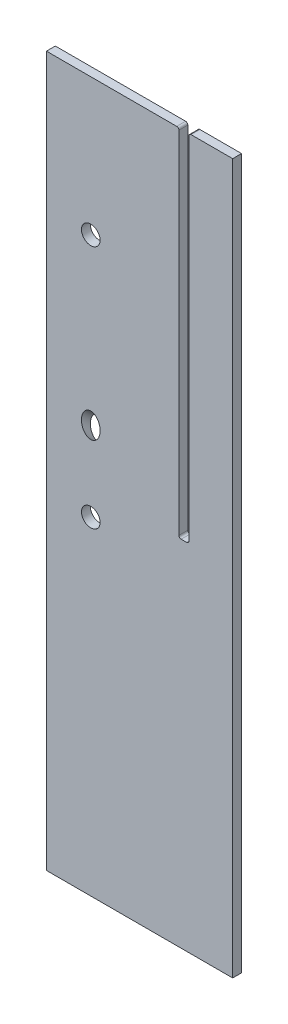
ISO-10303-21;
HEADER;
FILE_DESCRIPTION(('STEP AP214'),'2;1');
FILE_NAME('part.step','',(''),(''),'','','');
FILE_SCHEMA(('AUTOMOTIVE_DESIGN { 1 0 10303 214 1 1 1 1 }'));
ENDSEC;
DATA;
#1=APPLICATION_CONTEXT('core data for automotive mechanical design processes');
#2=APPLICATION_PROTOCOL_DEFINITION('international standard','automotive_design',2000,#1);
#3=PRODUCT_CONTEXT('',#1,'mechanical');
#4=PRODUCT('Part','Part','',(#3));
#5=PRODUCT_RELATED_PRODUCT_CATEGORY('part','',(#4));
#6=PRODUCT_DEFINITION_FORMATION('','',#4);
#7=PRODUCT_DEFINITION_CONTEXT('part definition',#1,'design');
#8=PRODUCT_DEFINITION('design','',#6,#7);
#9=PRODUCT_DEFINITION_SHAPE('','',#8);
#10=(LENGTH_UNIT() NAMED_UNIT(*) SI_UNIT(.MILLI.,.METRE.));
#11=(NAMED_UNIT(*) PLANE_ANGLE_UNIT() SI_UNIT($,.RADIAN.));
#12=(NAMED_UNIT(*) SI_UNIT($,.STERADIAN.) SOLID_ANGLE_UNIT());
#13=UNCERTAINTY_MEASURE_WITH_UNIT(LENGTH_MEASURE(1.E-05),#10,'distance_accuracy_value','');
#14=(GEOMETRIC_REPRESENTATION_CONTEXT(3) GLOBAL_UNCERTAINTY_ASSIGNED_CONTEXT((#13)) GLOBAL_UNIT_ASSIGNED_CONTEXT((#10,
#11,#12)) REPRESENTATION_CONTEXT('',''));
#15=CARTESIAN_POINT('',(0.,0.,0.));
#16=DIRECTION('',(0.,0.,1.));
#17=DIRECTION('',(1.,0.,0.));
#18=AXIS2_PLACEMENT_3D('',#15,#16,#17);
#19=CARTESIAN_POINT('',(-133.35,1016.,6.35));
#20=DIRECTION('',(0.,-1.,0.));
#21=DIRECTION('',(0.,0.,-1.));
#22=AXIS2_PLACEMENT_3D('',#19,#20,#21);
#23=PLANE('',#22);
#24=DIRECTION('',(-1.,0.,0.));
#25=VECTOR('',#24,1.);
#26=CARTESIAN_POINT('',(-133.35,1016.,-6.35));
#27=LINE('',#26,#25);
#28=CARTESIAN_POINT('',(133.35,1016.,-6.35));
#29=VERTEX_POINT('',#28);
#30=CARTESIAN_POINT('',(73.787,1016.,-6.35));
#31=VERTEX_POINT('',#30);
#32=EDGE_CURVE('E149',#29,#31,#27,.T.);
#33=ORIENTED_EDGE('',*,*,#32,.T.);
#34=DIRECTION('',(0.,0.,1.));
#35=VECTOR('',#34,1.);
#36=CARTESIAN_POINT('',(73.787,1016.,6.35));
#37=LINE('',#36,#35);
#38=CARTESIAN_POINT('',(73.787,1016.,6.35));
#39=VERTEX_POINT('',#38);
#40=EDGE_CURVE('E207',#31,#39,#37,.T.);
#41=ORIENTED_EDGE('',*,*,#40,.T.);
#42=DIRECTION('',(-1.,0.,0.));
#43=VECTOR('',#42,1.);
#44=CARTESIAN_POINT('',(-133.35,1016.,6.35));
#45=LINE('',#44,#43);
#46=CARTESIAN_POINT('',(133.35,1016.,6.35));
#47=VERTEX_POINT('',#46);
#48=EDGE_CURVE('E176',#47,#39,#45,.T.);
#49=ORIENTED_EDGE('',*,*,#48,.F.);
#50=DIRECTION('',(0.,0.,-1.));
#51=VECTOR('',#50,1.);
#52=CARTESIAN_POINT('',(133.35,1016.,6.35));
#53=LINE('',#52,#51);
#54=EDGE_CURVE('E189',#47,#29,#53,.T.);
#55=ORIENTED_EDGE('',*,*,#54,.T.);
#56=EDGE_LOOP('',(#33,#41,#49,#55));
#57=FACE_BOUND('',#56,.T.);
#58=ADVANCED_FACE('F46',(#57),#23,.F.);
#59=CARTESIAN_POINT('',(-133.35,0.,6.35));
#60=DIRECTION('',(1.,0.,0.));
#61=DIRECTION('',(0.,1.,0.));
#62=AXIS2_PLACEMENT_3D('',#59,#60,#61);
#63=PLANE('',#62);
#64=DIRECTION('',(0.,-1.,0.));
#65=VECTOR('',#64,1.);
#66=CARTESIAN_POINT('',(-133.35,0.,-6.35));
#67=LINE('',#66,#65);
#68=CARTESIAN_POINT('',(-133.35,1016.,-6.35));
#69=VERTEX_POINT('',#68);
#70=CARTESIAN_POINT('',(-133.35,0.,-6.35));
#71=VERTEX_POINT('',#70);
#72=EDGE_CURVE('E156',#69,#71,#67,.T.);
#73=ORIENTED_EDGE('',*,*,#72,.T.);
#74=DIRECTION('',(0.,0.,-1.));
#75=VECTOR('',#74,1.);
#76=CARTESIAN_POINT('',(-133.35,0.,6.35));
#77=LINE('',#76,#75);
#78=CARTESIAN_POINT('',(-133.35,0.,6.35));
#79=VERTEX_POINT('',#78);
#80=EDGE_CURVE('E331',#79,#71,#77,.T.);
#81=ORIENTED_EDGE('',*,*,#80,.F.);
#82=DIRECTION('',(0.,-1.,0.));
#83=VECTOR('',#82,1.);
#84=CARTESIAN_POINT('',(-133.35,0.,6.35));
#85=LINE('',#84,#83);
#86=CARTESIAN_POINT('',(-133.35,1016.,6.35));
#87=VERTEX_POINT('',#86);
#88=EDGE_CURVE('E158',#87,#79,#85,.T.);
#89=ORIENTED_EDGE('',*,*,#88,.F.);
#90=DIRECTION('',(0.,0.,-1.));
#91=VECTOR('',#90,1.);
#92=CARTESIAN_POINT('',(-133.35,1016.,6.35));
#93=LINE('',#92,#91);
#94=EDGE_CURVE('E142',#87,#69,#93,.T.);
#95=ORIENTED_EDGE('',*,*,#94,.T.);
#96=EDGE_LOOP('',(#73,#81,#89,#95));
#97=FACE_BOUND('',#96,.T.);
#98=ADVANCED_FACE('F154',(#97),#63,.F.);
#99=CARTESIAN_POINT('',(-133.35,0.,6.35));
#100=DIRECTION('',(0.,1.,0.));
#101=DIRECTION('',(-1.,0.,0.));
#102=AXIS2_PLACEMENT_3D('',#99,#100,#101);
#103=PLANE('',#102);
#104=DIRECTION('',(1.,0.,0.));
#105=VECTOR('',#104,1.);
#106=CARTESIAN_POINT('',(-133.35,0.,-6.35));
#107=LINE('',#106,#105);
#108=CARTESIAN_POINT('',(133.35,0.,-6.35));
#109=VERTEX_POINT('',#108);
#110=EDGE_CURVE('E160',#71,#109,#107,.T.);
#111=ORIENTED_EDGE('',*,*,#110,.T.);
#112=DIRECTION('',(0.,0.,-1.));
#113=VECTOR('',#112,1.);
#114=CARTESIAN_POINT('',(133.35,0.,6.35));
#115=LINE('',#114,#113);
#116=CARTESIAN_POINT('',(133.35,0.,6.35));
#117=VERTEX_POINT('',#116);
#118=EDGE_CURVE('E150',#117,#109,#115,.T.);
#119=ORIENTED_EDGE('',*,*,#118,.F.);
#120=DIRECTION('',(1.,0.,0.));
#121=VECTOR('',#120,1.);
#122=CARTESIAN_POINT('',(-133.35,0.,6.35));
#123=LINE('',#122,#121);
#124=EDGE_CURVE('E185',#79,#117,#123,.T.);
#125=ORIENTED_EDGE('',*,*,#124,.F.);
#126=ORIENTED_EDGE('',*,*,#80,.T.);
#127=EDGE_LOOP('',(#111,#119,#125,#126));
#128=FACE_BOUND('',#127,.T.);
#129=ADVANCED_FACE('F336',(#128),#103,.F.);
#130=CARTESIAN_POINT('',(133.35,0.,6.35));
#131=DIRECTION('',(-1.,0.,0.));
#132=DIRECTION('',(0.,0.,1.));
#133=AXIS2_PLACEMENT_3D('',#130,#131,#132);
#134=PLANE('',#133);
#135=DIRECTION('',(0.,1.,0.));
#136=VECTOR('',#135,1.);
#137=CARTESIAN_POINT('',(133.35,0.,-6.35));
#138=LINE('',#137,#136);
#139=EDGE_CURVE('E328',#109,#29,#138,.T.);
#140=ORIENTED_EDGE('',*,*,#139,.T.);
#141=ORIENTED_EDGE('',*,*,#54,.F.);
#142=DIRECTION('',(0.,1.,0.));
#143=VECTOR('',#142,1.);
#144=CARTESIAN_POINT('',(133.35,0.,6.35));
#145=LINE('',#144,#143);
#146=EDGE_CURVE('E182',#117,#47,#145,.T.);
#147=ORIENTED_EDGE('',*,*,#146,.F.);
#148=ORIENTED_EDGE('',*,*,#118,.T.);
#149=EDGE_LOOP('',(#140,#141,#147,#148));
#150=FACE_BOUND('',#149,.T.);
#151=ADVANCED_FACE('F338',(#150),#134,.F.);
#152=CARTESIAN_POINT('',(53.213,1016.,6.35));
#153=VERTEX_POINT('',#152);
#154=EDGE_CURVE('E181',#153,#87,#45,.T.);
#155=ORIENTED_EDGE('',*,*,#154,.F.);
#156=DIRECTION('',(0.,0.,1.));
#157=VECTOR('',#156,1.);
#158=CARTESIAN_POINT('',(53.213,1016.,6.35));
#159=LINE('',#158,#157);
#160=CARTESIAN_POINT('',(53.213,1016.,-6.35));
#161=VERTEX_POINT('',#160);
#162=EDGE_CURVE('E145',#153,#161,#159,.F.);
#163=ORIENTED_EDGE('',*,*,#162,.T.);
#164=EDGE_CURVE('E138',#161,#69,#27,.T.);
#165=ORIENTED_EDGE('',*,*,#164,.T.);
#166=ORIENTED_EDGE('',*,*,#94,.F.);
#167=EDGE_LOOP('',(#155,#163,#165,#166));
#168=FACE_BOUND('',#167,.T.);
#169=ADVANCED_FACE('F141',(#168),#23,.F.);
#170=CARTESIAN_POINT('',(0.,0.,6.35));
#171=DIRECTION('',(0.,0.,-1.));
#172=DIRECTION('',(-1.,0.,0.));
#173=AXIS2_PLACEMENT_3D('',#170,#171,#172);
#174=PLANE('',#173);
#175=CARTESIAN_POINT('',(-69.85,469.899999999998,6.35000000000002));
#176=DIRECTION('',(0.,0.,-1.));
#177=DIRECTION('',(-1.,0.,0.));
#178=AXIS2_PLACEMENT_3D('',#175,#176,#177);
#179=CIRCLE('',#178,13.335);
#180=CARTESIAN_POINT('',(-83.185,469.899999999998,6.35000000000002));
#181=VERTEX_POINT('',#180);
#182=EDGE_CURVE('E50',#181,#181,#179,.F.);
#183=ORIENTED_EDGE('',*,*,#182,.F.);
#184=EDGE_LOOP('',(#183));
#185=FACE_BOUND('',#184,.T.);
#186=CARTESIAN_POINT('',(-69.85,583.781250000006,6.35000000000002));
#187=DIRECTION('',(0.,0.,-1.));
#188=DIRECTION('',(0.,-1.,0.));
#189=AXIS2_PLACEMENT_3D('',#186,#187,#188);
#190=ELLIPSE('',#189,17.7191243016021,13.335);
#191=CARTESIAN_POINT('',(-69.85,566.062125698404,6.35000000000002));
#192=VERTEX_POINT('',#191);
#193=EDGE_CURVE('E262',#192,#192,#190,.F.);
#194=ORIENTED_EDGE('',*,*,#193,.F.);
#195=EDGE_LOOP('',(#194));
#196=FACE_BOUND('',#195,.T.);
#197=CARTESIAN_POINT('',(-69.85,819.899999999998,6.35000000000002));
#198=DIRECTION('',(0.,0.,-1.));
#199=DIRECTION('',(-1.,0.,0.));
#200=AXIS2_PLACEMENT_3D('',#197,#198,#199);
#201=CIRCLE('',#200,13.335);
#202=CARTESIAN_POINT('',(-83.185,819.899999999998,6.35000000000002));
#203=VERTEX_POINT('',#202);
#204=EDGE_CURVE('E257',#203,#203,#201,.F.);
#205=ORIENTED_EDGE('',*,*,#204,.F.);
#206=EDGE_LOOP('',(#205));
#207=FACE_BOUND('',#206,.T.);
#208=ORIENTED_EDGE('',*,*,#48,.T.);
#209=CARTESIAN_POINT('',(73.787,1012.825,6.35));
#210=DIRECTION('',(0.,0.,-1.));
#211=DIRECTION('',(-1.,0.,0.));
#212=AXIS2_PLACEMENT_3D('',#209,#210,#211);
#213=CIRCLE('',#212,3.175);
#214=CARTESIAN_POINT('',(70.612,1012.825,6.35));
#215=VERTEX_POINT('',#214);
#216=EDGE_CURVE('E214',#39,#215,#213,.F.);
#217=ORIENTED_EDGE('',*,*,#216,.T.);
#218=DIRECTION('',(0.,1.,0.));
#219=VECTOR('',#218,1.);
#220=CARTESIAN_POINT('',(70.612,1016.,6.35));
#221=LINE('',#220,#219);
#222=CARTESIAN_POINT('',(70.6120000000001,510.413,6.35));
#223=VERTEX_POINT('',#222);
#224=EDGE_CURVE('E195',#223,#215,#221,.T.);
#225=ORIENTED_EDGE('',*,*,#224,.F.);
#226=CARTESIAN_POINT('',(67.4370000000001,510.413,6.35));
#227=DIRECTION('',(0.,0.,-1.));
#228=DIRECTION('',(-1.,0.,0.));
#229=AXIS2_PLACEMENT_3D('',#226,#227,#228);
#230=CIRCLE('',#229,3.175);
#231=CARTESIAN_POINT('',(67.4370000000001,507.238,6.35));
#232=VERTEX_POINT('',#231);
#233=EDGE_CURVE('E245',#223,#232,#230,.T.);
#234=ORIENTED_EDGE('',*,*,#233,.T.);
#235=DIRECTION('',(1.,0.,0.));
#236=VECTOR('',#235,1.);
#237=CARTESIAN_POINT('',(69.8500000000001,507.238,6.35));
#238=LINE('',#237,#236);
#239=CARTESIAN_POINT('',(59.563,507.238,6.35));
#240=VERTEX_POINT('',#239);
#241=EDGE_CURVE('E194',#240,#232,#238,.T.);
#242=ORIENTED_EDGE('',*,*,#241,.F.);
#243=CARTESIAN_POINT('',(59.563,510.413,6.35));
#244=DIRECTION('',(0.,0.,-1.));
#245=DIRECTION('',(-1.,0.,0.));
#246=AXIS2_PLACEMENT_3D('',#243,#244,#245);
#247=CIRCLE('',#246,3.175);
#248=CARTESIAN_POINT('',(56.388,510.413,6.35));
#249=VERTEX_POINT('',#248);
#250=EDGE_CURVE('E56',#240,#249,#247,.T.);
#251=ORIENTED_EDGE('',*,*,#250,.T.);
#252=DIRECTION('',(0.,-1.,0.));
#253=VECTOR('',#252,1.);
#254=CARTESIAN_POINT('',(56.388,1016.,6.35));
#255=LINE('',#254,#253);
#256=CARTESIAN_POINT('',(56.388,1012.825,6.35));
#257=VERTEX_POINT('',#256);
#258=EDGE_CURVE('E199',#257,#249,#255,.T.);
#259=ORIENTED_EDGE('',*,*,#258,.F.);
#260=CARTESIAN_POINT('',(53.213,1012.825,6.35));
#261=DIRECTION('',(0.,0.,-1.));
#262=DIRECTION('',(-1.,0.,0.));
#263=AXIS2_PLACEMENT_3D('',#260,#261,#262);
#264=CIRCLE('',#263,3.175);
#265=EDGE_CURVE('E211',#257,#153,#264,.F.);
#266=ORIENTED_EDGE('',*,*,#265,.T.);
#267=ORIENTED_EDGE('',*,*,#154,.T.);
#268=ORIENTED_EDGE('',*,*,#88,.T.);
#269=ORIENTED_EDGE('',*,*,#124,.T.);
#270=ORIENTED_EDGE('',*,*,#146,.T.);
#271=EDGE_LOOP('',(#208,#217,#225,#234,#242,#251,#259,#266,#267,#268,#269,#270));
#272=FACE_BOUND('',#271,.T.);
#273=ADVANCED_FACE('F281',(#185,#196,#207,#272),#174,.F.);
#274=CARTESIAN_POINT('',(0.,0.,-6.35));
#275=DIRECTION('',(0.,0.,-1.));
#276=DIRECTION('',(-1.,0.,0.));
#277=AXIS2_PLACEMENT_3D('',#274,#275,#276);
#278=PLANE('',#277);
#279=DIRECTION('',(0.,1.,0.));
#280=VECTOR('',#279,1.);
#281=CARTESIAN_POINT('',(70.612,1016.,-6.35));
#282=LINE('',#281,#280);
#283=CARTESIAN_POINT('',(70.6120000000001,510.413,-6.35));
#284=VERTEX_POINT('',#283);
#285=CARTESIAN_POINT('',(70.612,1012.825,-6.35));
#286=VERTEX_POINT('',#285);
#287=EDGE_CURVE('E191',#284,#286,#282,.T.);
#288=ORIENTED_EDGE('',*,*,#287,.T.);
#289=CARTESIAN_POINT('',(73.787,1012.825,-6.35));
#290=DIRECTION('',(0.,0.,-1.));
#291=DIRECTION('',(-1.,0.,0.));
#292=AXIS2_PLACEMENT_3D('',#289,#290,#291);
#293=CIRCLE('',#292,3.175);
#294=EDGE_CURVE('E227',#286,#31,#293,.T.);
#295=ORIENTED_EDGE('',*,*,#294,.T.);
#296=ORIENTED_EDGE('',*,*,#32,.F.);
#297=ORIENTED_EDGE('',*,*,#139,.F.);
#298=ORIENTED_EDGE('',*,*,#110,.F.);
#299=ORIENTED_EDGE('',*,*,#72,.F.);
#300=ORIENTED_EDGE('',*,*,#164,.F.);
#301=CARTESIAN_POINT('',(53.213,1012.825,-6.35));
#302=DIRECTION('',(0.,0.,-1.));
#303=DIRECTION('',(-1.,0.,0.));
#304=AXIS2_PLACEMENT_3D('',#301,#302,#303);
#305=CIRCLE('',#304,3.175);
#306=CARTESIAN_POINT('',(56.388,1012.825,-6.35));
#307=VERTEX_POINT('',#306);
#308=EDGE_CURVE('E224',#161,#307,#305,.T.);
#309=ORIENTED_EDGE('',*,*,#308,.T.);
#310=DIRECTION('',(0.,-1.,0.));
#311=VECTOR('',#310,1.);
#312=CARTESIAN_POINT('',(56.388,1016.,-6.35));
#313=LINE('',#312,#311);
#314=CARTESIAN_POINT('',(56.388,510.413,-6.35));
#315=VERTEX_POINT('',#314);
#316=EDGE_CURVE('E171',#307,#315,#313,.T.);
#317=ORIENTED_EDGE('',*,*,#316,.T.);
#318=CARTESIAN_POINT('',(59.563,510.413,-6.35));
#319=DIRECTION('',(0.,0.,-1.));
#320=DIRECTION('',(-1.,0.,0.));
#321=AXIS2_PLACEMENT_3D('',#318,#319,#320);
#322=CIRCLE('',#321,3.175);
#323=CARTESIAN_POINT('',(59.563,507.238,-6.35));
#324=VERTEX_POINT('',#323);
#325=EDGE_CURVE('E12',#315,#324,#322,.F.);
#326=ORIENTED_EDGE('',*,*,#325,.T.);
#327=DIRECTION('',(1.,0.,0.));
#328=VECTOR('',#327,1.);
#329=CARTESIAN_POINT('',(69.8500000000001,507.238,-6.35));
#330=LINE('',#329,#328);
#331=CARTESIAN_POINT('',(67.4370000000001,507.238,-6.35));
#332=VERTEX_POINT('',#331);
#333=EDGE_CURVE('E168',#324,#332,#330,.T.);
#334=ORIENTED_EDGE('',*,*,#333,.T.);
#335=CARTESIAN_POINT('',(67.4370000000001,510.413,-6.35));
#336=DIRECTION('',(0.,0.,-1.));
#337=DIRECTION('',(-1.,0.,0.));
#338=AXIS2_PLACEMENT_3D('',#335,#336,#337);
#339=CIRCLE('',#338,3.175);
#340=EDGE_CURVE('E248',#332,#284,#339,.F.);
#341=ORIENTED_EDGE('',*,*,#340,.T.);
#342=EDGE_LOOP('',(#288,#295,#296,#297,#298,#299,#300,#309,#317,#326,#334,#341));
#343=FACE_BOUND('',#342,.T.);
#344=CARTESIAN_POINT('',(-69.85,469.899999999998,-6.35000000000002));
#345=DIRECTION('',(0.,0.,-1.));
#346=DIRECTION('',(-1.,0.,0.));
#347=AXIS2_PLACEMENT_3D('',#344,#345,#346);
#348=CIRCLE('',#347,13.335);
#349=CARTESIAN_POINT('',(-83.185,469.899999999998,-6.35000000000002));
#350=VERTEX_POINT('',#349);
#351=EDGE_CURVE('E180',#350,#350,#348,.F.);
#352=ORIENTED_EDGE('',*,*,#351,.T.);
#353=EDGE_LOOP('',(#352));
#354=FACE_BOUND('',#353,.T.);
#355=CARTESIAN_POINT('',(-69.85,572.668750000006,-6.35000000000002));
#356=DIRECTION('',(0.,0.,-1.));
#357=DIRECTION('',(0.,-1.,0.));
#358=AXIS2_PLACEMENT_3D('',#355,#356,#357);
#359=ELLIPSE('',#358,17.7191243016021,13.335);
#360=CARTESIAN_POINT('',(-69.85,554.949625698404,-6.35000000000002));
#361=VERTEX_POINT('',#360);
#362=EDGE_CURVE('E258',#361,#361,#359,.F.);
#363=ORIENTED_EDGE('',*,*,#362,.T.);
#364=EDGE_LOOP('',(#363));
#365=FACE_BOUND('',#364,.T.);
#366=CARTESIAN_POINT('',(-69.85,819.899999999998,-6.35000000000002));
#367=DIRECTION('',(0.,0.,-1.));
#368=DIRECTION('',(-1.,0.,0.));
#369=AXIS2_PLACEMENT_3D('',#366,#367,#368);
#370=CIRCLE('',#369,13.335);
#371=CARTESIAN_POINT('',(-83.185,819.899999999998,-6.35000000000002));
#372=VERTEX_POINT('',#371);
#373=EDGE_CURVE('E253',#372,#372,#370,.F.);
#374=ORIENTED_EDGE('',*,*,#373,.T.);
#375=EDGE_LOOP('',(#374));
#376=FACE_BOUND('',#375,.T.);
#377=ADVANCED_FACE('F163',(#343,#354,#365,#376),#278,.T.);
#378=CARTESIAN_POINT('',(-69.8499999999999,819.899999999998,276.199999999991));
#379=DIRECTION('',(0.,0.,-1.));
#380=DIRECTION('',(-1.,0.,0.));
#381=AXIS2_PLACEMENT_3D('',#378,#379,#380);
#382=CYLINDRICAL_SURFACE('',#381,13.335);
#383=ORIENTED_EDGE('',*,*,#373,.F.);
#384=EDGE_LOOP('',(#383));
#385=FACE_BOUND('',#384,.T.);
#386=ORIENTED_EDGE('',*,*,#204,.T.);
#387=EDGE_LOOP('',(#386));
#388=FACE_BOUND('',#387,.T.);
#389=ADVANCED_FACE('F355',(#385,#388),#382,.F.);
#390=CARTESIAN_POINT('',(-69.8499999999999,819.899999999998,276.199999999991));
#391=DIRECTION('',(0.,-0.658504607868519,-0.752576694706877));
#392=DIRECTION('',(0.,0.752576694706877,-0.658504607868519));
#393=AXIS2_PLACEMENT_3D('',#390,#391,#392);
#394=CYLINDRICAL_SURFACE('',#393,13.335);
#395=ORIENTED_EDGE('',*,*,#362,.F.);
#396=EDGE_LOOP('',(#395));
#397=FACE_BOUND('',#396,.T.);
#398=ORIENTED_EDGE('',*,*,#193,.T.);
#399=EDGE_LOOP('',(#398));
#400=FACE_BOUND('',#399,.T.);
#401=ADVANCED_FACE('F48',(#397,#400),#394,.F.);
#402=CARTESIAN_POINT('',(-69.8499999999999,469.899999999998,276.199999999994));
#403=DIRECTION('',(0.,0.,-1.));
#404=DIRECTION('',(-1.,0.,0.));
#405=AXIS2_PLACEMENT_3D('',#402,#403,#404);
#406=CYLINDRICAL_SURFACE('',#405,13.335);
#407=ORIENTED_EDGE('',*,*,#351,.F.);
#408=EDGE_LOOP('',(#407));
#409=FACE_BOUND('',#408,.T.);
#410=ORIENTED_EDGE('',*,*,#182,.T.);
#411=EDGE_LOOP('',(#410));
#412=FACE_BOUND('',#411,.T.);
#413=ADVANCED_FACE('F273',(#409,#412),#406,.F.);
#414=CARTESIAN_POINT('',(70.612,1016.,-6.35000000000002));
#415=DIRECTION('',(1.,0.,0.));
#416=DIRECTION('',(0.,1.,0.));
#417=AXIS2_PLACEMENT_3D('',#414,#415,#416);
#418=PLANE('',#417);
#419=ORIENTED_EDGE('',*,*,#224,.T.);
#420=DIRECTION('',(0.,0.,1.));
#421=VECTOR('',#420,1.);
#422=CARTESIAN_POINT('',(70.612,1012.825,-6.35000000000002));
#423=LINE('',#422,#421);
#424=EDGE_CURVE('E221',#215,#286,#423,.F.);
#425=ORIENTED_EDGE('',*,*,#424,.T.);
#426=ORIENTED_EDGE('',*,*,#287,.F.);
#427=DIRECTION('',(0.,0.,1.));
#428=VECTOR('',#427,1.);
#429=CARTESIAN_POINT('',(70.6120000000001,510.413,6.35));
#430=LINE('',#429,#428);
#431=EDGE_CURVE('E217',#284,#223,#430,.T.);
#432=ORIENTED_EDGE('',*,*,#431,.T.);
#433=EDGE_LOOP('',(#419,#425,#426,#432));
#434=FACE_BOUND('',#433,.T.);
#435=ADVANCED_FACE('F276',(#434),#418,.F.);
#436=CARTESIAN_POINT('',(69.8500000000001,507.238,-6.35000000000002));
#437=DIRECTION('',(0.,-1.,0.));
#438=DIRECTION('',(0.,0.,-1.));
#439=AXIS2_PLACEMENT_3D('',#436,#437,#438);
#440=PLANE('',#439);
#441=ORIENTED_EDGE('',*,*,#241,.T.);
#442=DIRECTION('',(0.,0.,1.));
#443=VECTOR('',#442,1.);
#444=CARTESIAN_POINT('',(67.4370000000001,507.238,-6.35));
#445=LINE('',#444,#443);
#446=EDGE_CURVE('E64',#232,#332,#445,.F.);
#447=ORIENTED_EDGE('',*,*,#446,.T.);
#448=ORIENTED_EDGE('',*,*,#333,.F.);
#449=DIRECTION('',(0.,0.,1.));
#450=VECTOR('',#449,1.);
#451=CARTESIAN_POINT('',(59.563,507.238,6.35));
#452=LINE('',#451,#450);
#453=EDGE_CURVE('E239',#324,#240,#452,.T.);
#454=ORIENTED_EDGE('',*,*,#453,.T.);
#455=EDGE_LOOP('',(#441,#447,#448,#454));
#456=FACE_BOUND('',#455,.T.);
#457=ADVANCED_FACE('F309',(#456),#440,.F.);
#458=CARTESIAN_POINT('',(56.388,1016.,-6.35000000000002));
#459=DIRECTION('',(-1.,0.,0.));
#460=DIRECTION('',(0.,-1.,0.));
#461=AXIS2_PLACEMENT_3D('',#458,#459,#460);
#462=PLANE('',#461);
#463=ORIENTED_EDGE('',*,*,#316,.F.);
#464=DIRECTION('',(0.,0.,1.));
#465=VECTOR('',#464,1.);
#466=CARTESIAN_POINT('',(56.388,1012.825,-6.35000000000002));
#467=LINE('',#466,#465);
#468=EDGE_CURVE('E233',#307,#257,#467,.T.);
#469=ORIENTED_EDGE('',*,*,#468,.T.);
#470=ORIENTED_EDGE('',*,*,#258,.T.);
#471=DIRECTION('',(0.,0.,1.));
#472=VECTOR('',#471,1.);
#473=CARTESIAN_POINT('',(56.388,510.413,-6.35));
#474=LINE('',#473,#472);
#475=EDGE_CURVE('E230',#249,#315,#474,.F.);
#476=ORIENTED_EDGE('',*,*,#475,.T.);
#477=EDGE_LOOP('',(#463,#469,#470,#476));
#478=FACE_BOUND('',#477,.T.);
#479=ADVANCED_FACE('F317',(#478),#462,.F.);
#480=CARTESIAN_POINT('',(73.787,1012.825,6.35));
#481=DIRECTION('',(0.,0.,1.));
#482=DIRECTION('',(1.,0.,0.));
#483=AXIS2_PLACEMENT_3D('',#480,#481,#482);
#484=CYLINDRICAL_SURFACE('',#483,3.175);
#485=ORIENTED_EDGE('',*,*,#294,.F.);
#486=ORIENTED_EDGE('',*,*,#424,.F.);
#487=ORIENTED_EDGE('',*,*,#216,.F.);
#488=ORIENTED_EDGE('',*,*,#40,.F.);
#489=EDGE_LOOP('',(#485,#486,#487,#488));
#490=FACE_BOUND('',#489,.T.);
#491=ADVANCED_FACE('F300',(#490),#484,.T.);
#492=CARTESIAN_POINT('',(53.213,1012.825,-6.35000000000002));
#493=DIRECTION('',(0.,0.,1.));
#494=DIRECTION('',(1.,0.,0.));
#495=AXIS2_PLACEMENT_3D('',#492,#493,#494);
#496=CYLINDRICAL_SURFACE('',#495,3.175);
#497=ORIENTED_EDGE('',*,*,#308,.F.);
#498=ORIENTED_EDGE('',*,*,#162,.F.);
#499=ORIENTED_EDGE('',*,*,#265,.F.);
#500=ORIENTED_EDGE('',*,*,#468,.F.);
#501=EDGE_LOOP('',(#497,#498,#499,#500));
#502=FACE_BOUND('',#501,.T.);
#503=ADVANCED_FACE('F320',(#502),#496,.T.);
#504=CARTESIAN_POINT('',(67.4370000000001,510.413,-6.35000000000002));
#505=DIRECTION('',(0.,0.,-1.));
#506=DIRECTION('',(-1.,0.,0.));
#507=AXIS2_PLACEMENT_3D('',#504,#505,#506);
#508=CYLINDRICAL_SURFACE('',#507,3.175);
#509=ORIENTED_EDGE('',*,*,#340,.F.);
#510=ORIENTED_EDGE('',*,*,#446,.F.);
#511=ORIENTED_EDGE('',*,*,#233,.F.);
#512=ORIENTED_EDGE('',*,*,#431,.F.);
#513=EDGE_LOOP('',(#509,#510,#511,#512));
#514=FACE_BOUND('',#513,.T.);
#515=ADVANCED_FACE('F307',(#514),#508,.F.);
#516=CARTESIAN_POINT('',(59.563,510.413,-6.35000000000002));
#517=DIRECTION('',(0.,0.,-1.));
#518=DIRECTION('',(-1.,0.,0.));
#519=AXIS2_PLACEMENT_3D('',#516,#517,#518);
#520=CYLINDRICAL_SURFACE('',#519,3.175);
#521=ORIENTED_EDGE('',*,*,#325,.F.);
#522=ORIENTED_EDGE('',*,*,#475,.F.);
#523=ORIENTED_EDGE('',*,*,#250,.F.);
#524=ORIENTED_EDGE('',*,*,#453,.F.);
#525=EDGE_LOOP('',(#521,#522,#523,#524));
#526=FACE_BOUND('',#525,.T.);
#527=ADVANCED_FACE('F312',(#526),#520,.F.);
#528=CLOSED_SHELL('',(#58,#98,#129,#151,#169,#273,#377,#389,#401,#413,#435,#457,#479,#491,#503,
#515,#527));
#529=MANIFOLD_SOLID_BREP('B2',#528);
#530=ADVANCED_BREP_SHAPE_REPRESENTATION('',(#18,#529),#14);
#531=SHAPE_DEFINITION_REPRESENTATION(#9,#530);
ENDSEC;
END-ISO-10303-21;
